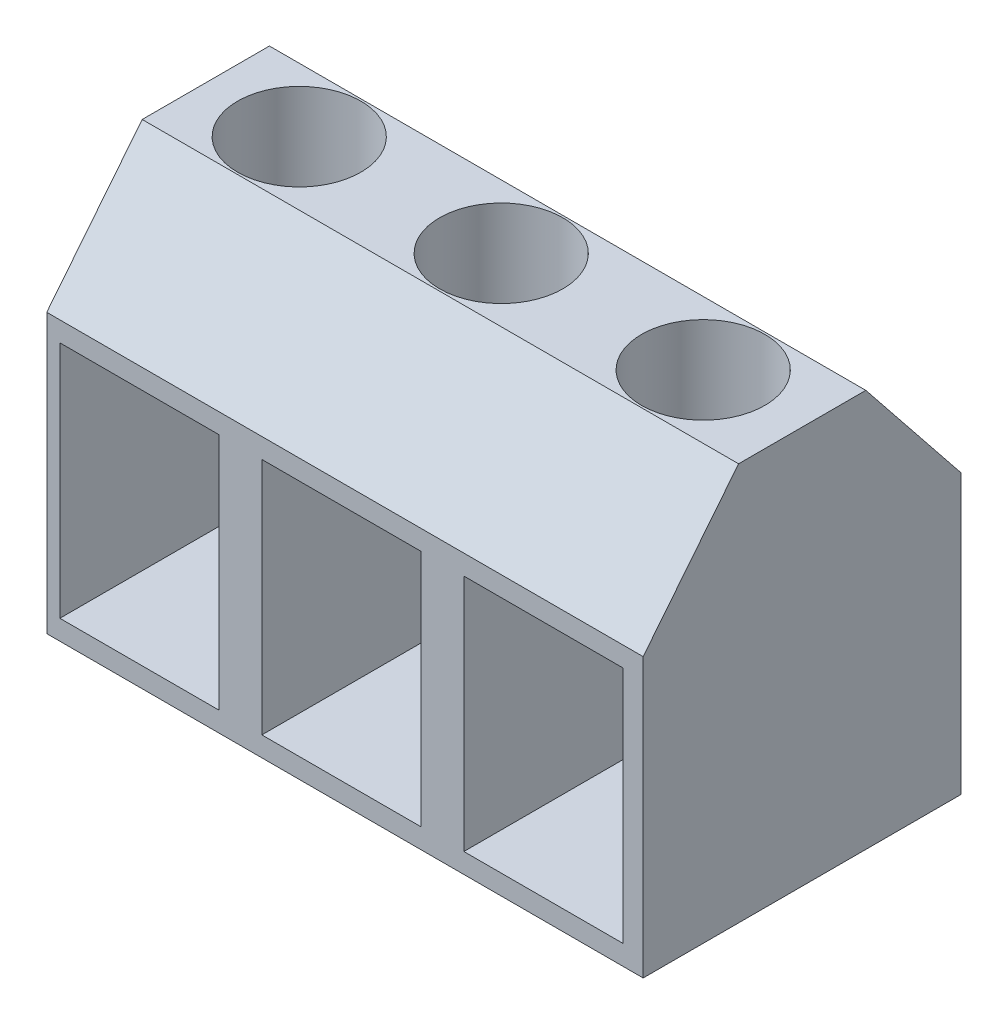
ISO-10303-21;
HEADER;
FILE_DESCRIPTION(('STEP AP214'),'2;1');
FILE_NAME('part.step','',(''),(''),'','','');
FILE_SCHEMA(('AUTOMOTIVE_DESIGN { 1 0 10303 214 1 1 1 1 }'));
ENDSEC;
DATA;
#1=APPLICATION_CONTEXT('core data for automotive mechanical design processes');
#2=APPLICATION_PROTOCOL_DEFINITION('international standard','automotive_design',2000,#1);
#3=PRODUCT_CONTEXT('',#1,'mechanical');
#4=PRODUCT('Part','Part','',(#3));
#5=PRODUCT_RELATED_PRODUCT_CATEGORY('part','',(#4));
#6=PRODUCT_DEFINITION_FORMATION('','',#4);
#7=PRODUCT_DEFINITION_CONTEXT('part definition',#1,'design');
#8=PRODUCT_DEFINITION('design','',#6,#7);
#9=PRODUCT_DEFINITION_SHAPE('','',#8);
#10=(LENGTH_UNIT() NAMED_UNIT(*) SI_UNIT(.MILLI.,.METRE.));
#11=(NAMED_UNIT(*) PLANE_ANGLE_UNIT() SI_UNIT($,.RADIAN.));
#12=(NAMED_UNIT(*) SI_UNIT($,.STERADIAN.) SOLID_ANGLE_UNIT());
#13=UNCERTAINTY_MEASURE_WITH_UNIT(LENGTH_MEASURE(1.E-05),#10,'distance_accuracy_value','');
#14=(GEOMETRIC_REPRESENTATION_CONTEXT(3) GLOBAL_UNCERTAINTY_ASSIGNED_CONTEXT((#13)) GLOBAL_UNIT_ASSIGNED_CONTEXT((#10,
#11,#12)) REPRESENTATION_CONTEXT('',''));
#15=CARTESIAN_POINT('',(0.,0.,0.));
#16=DIRECTION('',(0.,0.,1.));
#17=DIRECTION('',(1.,0.,0.));
#18=AXIS2_PLACEMENT_3D('',#15,#16,#17);
#19=CARTESIAN_POINT('',(15.,-3.7668913218139,2.85101682436601));
#20=DIRECTION('',(0.,-0.624695047554424,-0.78086880944303));
#21=DIRECTION('',(0.,0.78086880944303,-0.624695047554424));
#22=AXIS2_PLACEMENT_3D('',#19,#20,#21);
#23=PLANE('',#22);
#24=DIRECTION('',(0.,-0.78086880944303,0.624695047554424));
#25=VECTOR('',#24,1.);
#26=CARTESIAN_POINT('',(0.,-3.7668913218139,2.85101682436601));
#27=LINE('',#26,#25);
#28=CARTESIAN_POINT('',(0.,-0.766891321813898,0.451016824366012));
#29=VERTEX_POINT('',#28);
#30=CARTESIAN_POINT('',(0.,-3.7668913218139,2.85101682436601));
#31=VERTEX_POINT('',#30);
#32=EDGE_CURVE('E249',#29,#31,#27,.T.);
#33=ORIENTED_EDGE('',*,*,#32,.T.);
#34=DIRECTION('',(-1.,0.,0.));
#35=VECTOR('',#34,1.);
#36=CARTESIAN_POINT('',(15.,-3.7668913218139,2.85101682436601));
#37=LINE('',#36,#35);
#38=CARTESIAN_POINT('',(15.,-3.7668913218139,2.85101682436601));
#39=VERTEX_POINT('',#38);
#40=EDGE_CURVE('E12',#39,#31,#37,.T.);
#41=ORIENTED_EDGE('',*,*,#40,.F.);
#42=DIRECTION('',(0.,-0.78086880944303,0.624695047554424));
#43=VECTOR('',#42,1.);
#44=CARTESIAN_POINT('',(15.,-3.7668913218139,2.85101682436601));
#45=LINE('',#44,#43);
#46=CARTESIAN_POINT('',(15.,-0.766891321813898,0.451016824366012));
#47=VERTEX_POINT('',#46);
#48=EDGE_CURVE('E250',#47,#39,#45,.T.);
#49=ORIENTED_EDGE('',*,*,#48,.F.);
#50=DIRECTION('',(-1.,0.,0.));
#51=VECTOR('',#50,1.);
#52=CARTESIAN_POINT('',(15.,-0.766891321813898,0.451016824366012));
#53=LINE('',#52,#51);
#54=EDGE_CURVE('E264',#47,#29,#53,.T.);
#55=ORIENTED_EDGE('',*,*,#54,.T.);
#56=EDGE_LOOP('',(#33,#41,#49,#55));
#57=FACE_BOUND('',#56,.T.);
#58=ADVANCED_FACE('F34',(#57),#23,.F.);
#59=CARTESIAN_POINT('',(15.,-10.7668913218139,2.85101682436601));
#60=DIRECTION('',(0.,0.,-1.));
#61=DIRECTION('',(-1.,0.,0.));
#62=AXIS2_PLACEMENT_3D('',#59,#60,#61);
#63=PLANE('',#62);
#64=DIRECTION('',(1.,0.,0.));
#65=VECTOR('',#64,1.);
#66=CARTESIAN_POINT('',(5.41,-10.2668913218139,2.85101682436601));
#67=LINE('',#66,#65);
#68=CARTESIAN_POINT('',(5.41,-10.2668913218139,2.85101682436601));
#69=VERTEX_POINT('',#68);
#70=CARTESIAN_POINT('',(9.41,-10.2668913218139,2.85101682436601));
#71=VERTEX_POINT('',#70);
#72=EDGE_CURVE('E175',#69,#71,#67,.T.);
#73=ORIENTED_EDGE('',*,*,#72,.F.);
#74=DIRECTION('',(0.,-1.,0.));
#75=VECTOR('',#74,1.);
#76=CARTESIAN_POINT('',(5.41,-10.2668913218139,2.85101682436601));
#77=LINE('',#76,#75);
#78=CARTESIAN_POINT('',(5.41,-4.2668913218139,2.85101682436601));
#79=VERTEX_POINT('',#78);
#80=EDGE_CURVE('E48',#79,#69,#77,.T.);
#81=ORIENTED_EDGE('',*,*,#80,.F.);
#82=DIRECTION('',(-1.,0.,0.));
#83=VECTOR('',#82,1.);
#84=CARTESIAN_POINT('',(5.41,-4.2668913218139,2.85101682436601));
#85=LINE('',#84,#83);
#86=CARTESIAN_POINT('',(9.41,-4.2668913218139,2.85101682436601));
#87=VERTEX_POINT('',#86);
#88=EDGE_CURVE('E182',#87,#79,#85,.T.);
#89=ORIENTED_EDGE('',*,*,#88,.F.);
#90=DIRECTION('',(0.,1.,0.));
#91=VECTOR('',#90,1.);
#92=CARTESIAN_POINT('',(9.41,-10.2668913218139,2.85101682436601));
#93=LINE('',#92,#91);
#94=EDGE_CURVE('E165',#71,#87,#93,.T.);
#95=ORIENTED_EDGE('',*,*,#94,.F.);
#96=EDGE_LOOP('',(#73,#81,#89,#95));
#97=FACE_BOUND('',#96,.T.);
#98=DIRECTION('',(1.,0.,0.));
#99=VECTOR('',#98,1.);
#100=CARTESIAN_POINT('',(10.49,-10.2668913218139,2.85101682436601));
#101=LINE('',#100,#99);
#102=CARTESIAN_POINT('',(10.49,-10.2668913218139,2.85101682436601));
#103=VERTEX_POINT('',#102);
#104=CARTESIAN_POINT('',(14.49,-10.2668913218139,2.85101682436601));
#105=VERTEX_POINT('',#104);
#106=EDGE_CURVE('E204',#103,#105,#101,.T.);
#107=ORIENTED_EDGE('',*,*,#106,.F.);
#108=DIRECTION('',(0.,-1.,0.));
#109=VECTOR('',#108,1.);
#110=CARTESIAN_POINT('',(10.49,-10.2668913218139,2.85101682436601));
#111=LINE('',#110,#109);
#112=CARTESIAN_POINT('',(10.49,-4.2668913218139,2.85101682436601));
#113=VERTEX_POINT('',#112);
#114=EDGE_CURVE('E56',#113,#103,#111,.T.);
#115=ORIENTED_EDGE('',*,*,#114,.F.);
#116=DIRECTION('',(-1.,0.,0.));
#117=VECTOR('',#116,1.);
#118=CARTESIAN_POINT('',(10.49,-4.2668913218139,2.85101682436601));
#119=LINE('',#118,#117);
#120=CARTESIAN_POINT('',(14.49,-4.2668913218139,2.85101682436601));
#121=VERTEX_POINT('',#120);
#122=EDGE_CURVE('E211',#121,#113,#119,.T.);
#123=ORIENTED_EDGE('',*,*,#122,.F.);
#124=DIRECTION('',(0.,1.,0.));
#125=VECTOR('',#124,1.);
#126=CARTESIAN_POINT('',(14.49,-10.2668913218139,2.85101682436601));
#127=LINE('',#126,#125);
#128=EDGE_CURVE('E208',#105,#121,#127,.T.);
#129=ORIENTED_EDGE('',*,*,#128,.F.);
#130=EDGE_LOOP('',(#107,#115,#123,#129));
#131=FACE_BOUND('',#130,.T.);
#132=DIRECTION('',(1.,0.,0.));
#133=VECTOR('',#132,1.);
#134=CARTESIAN_POINT('',(0.33,-10.2668913218139,2.85101682436601));
#135=LINE('',#134,#133);
#136=CARTESIAN_POINT('',(0.33,-10.2668913218139,2.85101682436601));
#137=VERTEX_POINT('',#136);
#138=CARTESIAN_POINT('',(4.33,-10.2668913218139,2.85101682436601));
#139=VERTEX_POINT('',#138);
#140=EDGE_CURVE('E231',#137,#139,#135,.T.);
#141=ORIENTED_EDGE('',*,*,#140,.F.);
#142=DIRECTION('',(0.,-1.,0.));
#143=VECTOR('',#142,1.);
#144=CARTESIAN_POINT('',(0.33,-10.2668913218139,2.85101682436601));
#145=LINE('',#144,#143);
#146=CARTESIAN_POINT('',(0.33,-4.2668913218139,2.85101682436601));
#147=VERTEX_POINT('',#146);
#148=EDGE_CURVE('E193',#147,#137,#145,.T.);
#149=ORIENTED_EDGE('',*,*,#148,.F.);
#150=DIRECTION('',(-1.,0.,0.));
#151=VECTOR('',#150,1.);
#152=CARTESIAN_POINT('',(0.33,-4.2668913218139,2.85101682436601));
#153=LINE('',#152,#151);
#154=CARTESIAN_POINT('',(4.33,-4.2668913218139,2.85101682436601));
#155=VERTEX_POINT('',#154);
#156=EDGE_CURVE('E237',#155,#147,#153,.T.);
#157=ORIENTED_EDGE('',*,*,#156,.F.);
#158=DIRECTION('',(0.,1.,0.));
#159=VECTOR('',#158,1.);
#160=CARTESIAN_POINT('',(4.33,-10.2668913218139,2.85101682436601));
#161=LINE('',#160,#159);
#162=EDGE_CURVE('E234',#139,#155,#161,.T.);
#163=ORIENTED_EDGE('',*,*,#162,.F.);
#164=EDGE_LOOP('',(#141,#149,#157,#163));
#165=FACE_BOUND('',#164,.T.);
#166=DIRECTION('',(0.,-1.,0.));
#167=VECTOR('',#166,1.);
#168=CARTESIAN_POINT('',(0.,-10.7668913218139,2.85101682436601));
#169=LINE('',#168,#167);
#170=CARTESIAN_POINT('',(0.,-10.7668913218139,2.85101682436601));
#171=VERTEX_POINT('',#170);
#172=EDGE_CURVE('E267',#31,#171,#169,.T.);
#173=ORIENTED_EDGE('',*,*,#172,.T.);
#174=DIRECTION('',(-1.,0.,0.));
#175=VECTOR('',#174,1.);
#176=CARTESIAN_POINT('',(15.,-10.7668913218139,2.85101682436601));
#177=LINE('',#176,#175);
#178=CARTESIAN_POINT('',(15.,-10.7668913218139,2.85101682436601));
#179=VERTEX_POINT('',#178);
#180=EDGE_CURVE('E41',#179,#171,#177,.T.);
#181=ORIENTED_EDGE('',*,*,#180,.F.);
#182=DIRECTION('',(0.,-1.,0.));
#183=VECTOR('',#182,1.);
#184=CARTESIAN_POINT('',(15.,-10.7668913218139,2.85101682436601));
#185=LINE('',#184,#183);
#186=EDGE_CURVE('E253',#39,#179,#185,.T.);
#187=ORIENTED_EDGE('',*,*,#186,.F.);
#188=ORIENTED_EDGE('',*,*,#40,.T.);
#189=EDGE_LOOP('',(#173,#181,#187,#188));
#190=FACE_BOUND('',#189,.T.);
#191=ADVANCED_FACE('F179',(#97,#131,#165,#190),#63,.F.);
#192=CARTESIAN_POINT('',(15.,-10.7668913218139,-5.14898317563399));
#193=DIRECTION('',(0.,1.,0.));
#194=DIRECTION('',(0.,0.,1.));
#195=AXIS2_PLACEMENT_3D('',#192,#193,#194);
#196=PLANE('',#195);
#197=DIRECTION('',(0.,0.,-1.));
#198=VECTOR('',#197,1.);
#199=CARTESIAN_POINT('',(0.,-10.7668913218139,-5.14898317563399));
#200=LINE('',#199,#198);
#201=CARTESIAN_POINT('',(0.,-10.7668913218139,-5.14898317563399));
#202=VERTEX_POINT('',#201);
#203=EDGE_CURVE('E269',#171,#202,#200,.T.);
#204=ORIENTED_EDGE('',*,*,#203,.T.);
#205=DIRECTION('',(-1.,0.,0.));
#206=VECTOR('',#205,1.);
#207=CARTESIAN_POINT('',(15.,-10.7668913218139,-5.14898317563399));
#208=LINE('',#207,#206);
#209=CARTESIAN_POINT('',(15.,-10.7668913218139,-5.14898317563399));
#210=VERTEX_POINT('',#209);
#211=EDGE_CURVE('E284',#210,#202,#208,.T.);
#212=ORIENTED_EDGE('',*,*,#211,.F.);
#213=DIRECTION('',(0.,0.,-1.));
#214=VECTOR('',#213,1.);
#215=CARTESIAN_POINT('',(15.,-10.7668913218139,-5.14898317563399));
#216=LINE('',#215,#214);
#217=EDGE_CURVE('E256',#179,#210,#216,.T.);
#218=ORIENTED_EDGE('',*,*,#217,.F.);
#219=ORIENTED_EDGE('',*,*,#180,.T.);
#220=EDGE_LOOP('',(#204,#212,#218,#219));
#221=FACE_BOUND('',#220,.T.);
#222=ADVANCED_FACE('F291',(#221),#196,.F.);
#223=CARTESIAN_POINT('',(15.,-3.7668913218139,-5.14898317563399));
#224=DIRECTION('',(0.,0.,1.));
#225=DIRECTION('',(1.,0.,0.));
#226=AXIS2_PLACEMENT_3D('',#223,#224,#225);
#227=PLANE('',#226);
#228=DIRECTION('',(0.,1.,0.));
#229=VECTOR('',#228,1.);
#230=CARTESIAN_POINT('',(0.,-3.7668913218139,-5.14898317563399));
#231=LINE('',#230,#229);
#232=CARTESIAN_POINT('',(0.,-3.7668913218139,-5.14898317563399));
#233=VERTEX_POINT('',#232);
#234=EDGE_CURVE('E271',#202,#233,#231,.T.);
#235=ORIENTED_EDGE('',*,*,#234,.T.);
#236=DIRECTION('',(-1.,0.,0.));
#237=VECTOR('',#236,1.);
#238=CARTESIAN_POINT('',(15.,-3.7668913218139,-5.14898317563399));
#239=LINE('',#238,#237);
#240=CARTESIAN_POINT('',(15.,-3.7668913218139,-5.14898317563399));
#241=VERTEX_POINT('',#240);
#242=EDGE_CURVE('E281',#241,#233,#239,.T.);
#243=ORIENTED_EDGE('',*,*,#242,.F.);
#244=DIRECTION('',(0.,1.,0.));
#245=VECTOR('',#244,1.);
#246=CARTESIAN_POINT('',(15.,-3.7668913218139,-5.14898317563399));
#247=LINE('',#246,#245);
#248=EDGE_CURVE('E258',#210,#241,#247,.T.);
#249=ORIENTED_EDGE('',*,*,#248,.F.);
#250=ORIENTED_EDGE('',*,*,#211,.T.);
#251=EDGE_LOOP('',(#235,#243,#249,#250));
#252=FACE_BOUND('',#251,.T.);
#253=ADVANCED_FACE('F302',(#252),#227,.F.);
#254=CARTESIAN_POINT('',(15.,-0.766891321813898,-2.74898317563399));
#255=DIRECTION('',(0.,-0.624695047554424,0.78086880944303));
#256=DIRECTION('',(0.,-0.78086880944303,-0.624695047554424));
#257=AXIS2_PLACEMENT_3D('',#254,#255,#256);
#258=PLANE('',#257);
#259=DIRECTION('',(0.,0.78086880944303,0.624695047554424));
#260=VECTOR('',#259,1.);
#261=CARTESIAN_POINT('',(0.,-0.766891321813898,-2.74898317563399));
#262=LINE('',#261,#260);
#263=CARTESIAN_POINT('',(0.,-0.766891321813898,-2.74898317563399));
#264=VERTEX_POINT('',#263);
#265=EDGE_CURVE('E273',#233,#264,#262,.T.);
#266=ORIENTED_EDGE('',*,*,#265,.T.);
#267=DIRECTION('',(-1.,0.,0.));
#268=VECTOR('',#267,1.);
#269=CARTESIAN_POINT('',(15.,-0.766891321813898,-2.74898317563399));
#270=LINE('',#269,#268);
#271=CARTESIAN_POINT('',(15.,-0.766891321813898,-2.74898317563399));
#272=VERTEX_POINT('',#271);
#273=EDGE_CURVE('E278',#272,#264,#270,.T.);
#274=ORIENTED_EDGE('',*,*,#273,.F.);
#275=DIRECTION('',(0.,0.78086880944303,0.624695047554424));
#276=VECTOR('',#275,1.);
#277=CARTESIAN_POINT('',(15.,-0.766891321813898,-2.74898317563399));
#278=LINE('',#277,#276);
#279=EDGE_CURVE('E260',#241,#272,#278,.T.);
#280=ORIENTED_EDGE('',*,*,#279,.F.);
#281=ORIENTED_EDGE('',*,*,#242,.T.);
#282=EDGE_LOOP('',(#266,#274,#280,#281));
#283=FACE_BOUND('',#282,.T.);
#284=ADVANCED_FACE('F306',(#283),#258,.F.);
#285=CARTESIAN_POINT('',(15.,-0.766891321813898,0.451016824366012));
#286=DIRECTION('',(0.,-1.,0.));
#287=DIRECTION('',(0.,0.,-1.));
#288=AXIS2_PLACEMENT_3D('',#285,#286,#287);
#289=PLANE('',#288);
#290=CARTESIAN_POINT('',(7.43,-0.766891321813898,-1.14898317563399));
#291=DIRECTION('',(0.,1.,0.));
#292=DIRECTION('',(0.,0.,1.));
#293=AXIS2_PLACEMENT_3D('',#290,#291,#292);
#294=CIRCLE('',#293,1.55);
#295=CARTESIAN_POINT('',(7.43,-0.766891321813898,0.401016824366011));
#296=VERTEX_POINT('',#295);
#297=EDGE_CURVE('E556',#296,#296,#294,.T.);
#298=ORIENTED_EDGE('',*,*,#297,.F.);
#299=EDGE_LOOP('',(#298));
#300=FACE_BOUND('',#299,.T.);
#301=CARTESIAN_POINT('',(12.51,-0.766891321813898,-1.14898317563399));
#302=DIRECTION('',(0.,1.,0.));
#303=DIRECTION('',(0.,0.,1.));
#304=AXIS2_PLACEMENT_3D('',#301,#302,#303);
#305=CIRCLE('',#304,1.55);
#306=CARTESIAN_POINT('',(12.51,-0.766891321813898,0.401016824366011));
#307=VERTEX_POINT('',#306);
#308=EDGE_CURVE('E554',#307,#307,#305,.T.);
#309=ORIENTED_EDGE('',*,*,#308,.F.);
#310=EDGE_LOOP('',(#309));
#311=FACE_BOUND('',#310,.T.);
#312=CARTESIAN_POINT('',(2.35,-0.766891321813898,-1.14898317563399));
#313=DIRECTION('',(0.,1.,0.));
#314=DIRECTION('',(0.,0.,1.));
#315=AXIS2_PLACEMENT_3D('',#312,#313,#314);
#316=CIRCLE('',#315,1.55);
#317=CARTESIAN_POINT('',(2.35,-0.766891321813898,0.401016824366012));
#318=VERTEX_POINT('',#317);
#319=EDGE_CURVE('E562',#318,#318,#316,.T.);
#320=ORIENTED_EDGE('',*,*,#319,.F.);
#321=EDGE_LOOP('',(#320));
#322=FACE_BOUND('',#321,.T.);
#323=DIRECTION('',(0.,0.,1.));
#324=VECTOR('',#323,1.);
#325=CARTESIAN_POINT('',(0.,-0.766891321813898,0.451016824366012));
#326=LINE('',#325,#324);
#327=EDGE_CURVE('E254',#264,#29,#326,.T.);
#328=ORIENTED_EDGE('',*,*,#327,.T.);
#329=ORIENTED_EDGE('',*,*,#54,.F.);
#330=DIRECTION('',(0.,0.,1.));
#331=VECTOR('',#330,1.);
#332=CARTESIAN_POINT('',(15.,-0.766891321813898,0.451016824366012));
#333=LINE('',#332,#331);
#334=EDGE_CURVE('E262',#272,#47,#333,.T.);
#335=ORIENTED_EDGE('',*,*,#334,.F.);
#336=ORIENTED_EDGE('',*,*,#273,.T.);
#337=EDGE_LOOP('',(#328,#329,#335,#336));
#338=FACE_BOUND('',#337,.T.);
#339=ADVANCED_FACE('F316',(#300,#311,#322,#338),#289,.F.);
#340=CARTESIAN_POINT('',(15.,0.,0.));
#341=DIRECTION('',(-1.,0.,0.));
#342=DIRECTION('',(0.,0.,1.));
#343=AXIS2_PLACEMENT_3D('',#340,#341,#342);
#344=PLANE('',#343);
#345=ORIENTED_EDGE('',*,*,#48,.T.);
#346=ORIENTED_EDGE('',*,*,#186,.T.);
#347=ORIENTED_EDGE('',*,*,#217,.T.);
#348=ORIENTED_EDGE('',*,*,#248,.T.);
#349=ORIENTED_EDGE('',*,*,#279,.T.);
#350=ORIENTED_EDGE('',*,*,#334,.T.);
#351=EDGE_LOOP('',(#345,#346,#347,#348,#349,#350));
#352=FACE_BOUND('',#351,.T.);
#353=ADVANCED_FACE('F310',(#352),#344,.F.);
#354=CARTESIAN_POINT('',(0.,0.,0.));
#355=DIRECTION('',(-1.,0.,0.));
#356=DIRECTION('',(0.,0.,1.));
#357=AXIS2_PLACEMENT_3D('',#354,#355,#356);
#358=PLANE('',#357);
#359=ORIENTED_EDGE('',*,*,#32,.F.);
#360=ORIENTED_EDGE('',*,*,#327,.F.);
#361=ORIENTED_EDGE('',*,*,#265,.F.);
#362=ORIENTED_EDGE('',*,*,#234,.F.);
#363=ORIENTED_EDGE('',*,*,#203,.F.);
#364=ORIENTED_EDGE('',*,*,#172,.F.);
#365=EDGE_LOOP('',(#359,#360,#361,#362,#363,#364));
#366=FACE_BOUND('',#365,.T.);
#367=ADVANCED_FACE('F297',(#366),#358,.T.);
#368=CARTESIAN_POINT('',(0.33,-10.2668913218139,-12.360085726562));
#369=DIRECTION('',(-1.,0.,0.));
#370=DIRECTION('',(0.,0.,1.));
#371=AXIS2_PLACEMENT_3D('',#368,#369,#370);
#372=PLANE('',#371);
#373=DIRECTION('',(0.,1.,0.));
#374=VECTOR('',#373,1.);
#375=CARTESIAN_POINT('',(0.33,-10.2668913218139,-4.64898317563399));
#376=LINE('',#375,#374);
#377=CARTESIAN_POINT('',(0.33,-10.2668913218139,-4.64898317563399));
#378=VERTEX_POINT('',#377);
#379=CARTESIAN_POINT('',(0.33,-4.2668913218139,-4.64898317563399));
#380=VERTEX_POINT('',#379);
#381=EDGE_CURVE('E227',#378,#380,#376,.T.);
#382=ORIENTED_EDGE('',*,*,#381,.T.);
#383=DIRECTION('',(0.,0.,1.));
#384=VECTOR('',#383,1.);
#385=CARTESIAN_POINT('',(0.33,-4.2668913218139,-12.360085726562));
#386=LINE('',#385,#384);
#387=EDGE_CURVE('E225',#380,#147,#386,.T.);
#388=ORIENTED_EDGE('',*,*,#387,.T.);
#389=ORIENTED_EDGE('',*,*,#148,.T.);
#390=DIRECTION('',(0.,0.,1.));
#391=VECTOR('',#390,1.);
#392=CARTESIAN_POINT('',(0.33,-10.2668913218139,-12.360085726562));
#393=LINE('',#392,#391);
#394=EDGE_CURVE('E240',#378,#137,#393,.T.);
#395=ORIENTED_EDGE('',*,*,#394,.F.);
#396=EDGE_LOOP('',(#382,#388,#389,#395));
#397=FACE_BOUND('',#396,.T.);
#398=ADVANCED_FACE('F362',(#397),#372,.F.);
#399=CARTESIAN_POINT('',(0.33,-4.2668913218139,-12.360085726562));
#400=DIRECTION('',(0.,1.,0.));
#401=DIRECTION('',(0.,0.,1.));
#402=AXIS2_PLACEMENT_3D('',#399,#400,#401);
#403=PLANE('',#402);
#404=CARTESIAN_POINT('',(2.35,-4.2668913218139,-1.14898317563399));
#405=DIRECTION('',(0.,1.,0.));
#406=DIRECTION('',(0.,0.,1.));
#407=AXIS2_PLACEMENT_3D('',#404,#405,#406);
#408=CIRCLE('',#407,1.55);
#409=CARTESIAN_POINT('',(2.35,-4.2668913218139,0.401016824366012));
#410=VERTEX_POINT('',#409);
#411=EDGE_CURVE('E205',#410,#410,#408,.F.);
#412=ORIENTED_EDGE('',*,*,#411,.F.);
#413=EDGE_LOOP('',(#412));
#414=FACE_BOUND('',#413,.T.);
#415=DIRECTION('',(1.,0.,0.));
#416=VECTOR('',#415,1.);
#417=CARTESIAN_POINT('',(0.33,-4.2668913218139,-4.64898317563399));
#418=LINE('',#417,#416);
#419=CARTESIAN_POINT('',(4.33,-4.2668913218139,-4.64898317563399));
#420=VERTEX_POINT('',#419);
#421=EDGE_CURVE('E224',#380,#420,#418,.T.);
#422=ORIENTED_EDGE('',*,*,#421,.T.);
#423=DIRECTION('',(0.,0.,1.));
#424=VECTOR('',#423,1.);
#425=CARTESIAN_POINT('',(4.33,-4.2668913218139,-12.360085726562));
#426=LINE('',#425,#424);
#427=EDGE_CURVE('E242',#420,#155,#426,.T.);
#428=ORIENTED_EDGE('',*,*,#427,.T.);
#429=ORIENTED_EDGE('',*,*,#156,.T.);
#430=ORIENTED_EDGE('',*,*,#387,.F.);
#431=EDGE_LOOP('',(#422,#428,#429,#430));
#432=FACE_BOUND('',#431,.T.);
#433=ADVANCED_FACE('F377',(#414,#432),#403,.F.);
#434=CARTESIAN_POINT('',(4.33,-10.2668913218139,-12.360085726562));
#435=DIRECTION('',(1.,0.,0.));
#436=DIRECTION('',(0.,0.,-1.));
#437=AXIS2_PLACEMENT_3D('',#434,#435,#436);
#438=PLANE('',#437);
#439=DIRECTION('',(0.,-1.,0.));
#440=VECTOR('',#439,1.);
#441=CARTESIAN_POINT('',(4.33,-10.2668913218139,-4.64898317563399));
#442=LINE('',#441,#440);
#443=CARTESIAN_POINT('',(4.33,-10.2668913218139,-4.64898317563399));
#444=VERTEX_POINT('',#443);
#445=EDGE_CURVE('E222',#420,#444,#442,.T.);
#446=ORIENTED_EDGE('',*,*,#445,.T.);
#447=DIRECTION('',(0.,0.,1.));
#448=VECTOR('',#447,1.);
#449=CARTESIAN_POINT('',(4.33,-10.2668913218139,-12.360085726562));
#450=LINE('',#449,#448);
#451=EDGE_CURVE('E244',#444,#139,#450,.T.);
#452=ORIENTED_EDGE('',*,*,#451,.T.);
#453=ORIENTED_EDGE('',*,*,#162,.T.);
#454=ORIENTED_EDGE('',*,*,#427,.F.);
#455=EDGE_LOOP('',(#446,#452,#453,#454));
#456=FACE_BOUND('',#455,.T.);
#457=ADVANCED_FACE('F385',(#456),#438,.F.);
#458=CARTESIAN_POINT('',(0.33,-10.2668913218139,-12.360085726562));
#459=DIRECTION('',(0.,-1.,0.));
#460=DIRECTION('',(0.,0.,-1.));
#461=AXIS2_PLACEMENT_3D('',#458,#459,#460);
#462=PLANE('',#461);
#463=DIRECTION('',(-1.,0.,0.));
#464=VECTOR('',#463,1.);
#465=CARTESIAN_POINT('',(0.33,-10.2668913218139,-4.64898317563399));
#466=LINE('',#465,#464);
#467=EDGE_CURVE('E229',#444,#378,#466,.T.);
#468=ORIENTED_EDGE('',*,*,#467,.T.);
#469=ORIENTED_EDGE('',*,*,#394,.T.);
#470=ORIENTED_EDGE('',*,*,#140,.T.);
#471=ORIENTED_EDGE('',*,*,#451,.F.);
#472=EDGE_LOOP('',(#468,#469,#470,#471));
#473=FACE_BOUND('',#472,.T.);
#474=ADVANCED_FACE('F390',(#473),#462,.F.);
#475=CARTESIAN_POINT('',(15.,-3.7668913218139,-4.64898317563399));
#476=DIRECTION('',(0.,0.,1.));
#477=DIRECTION('',(1.,0.,0.));
#478=AXIS2_PLACEMENT_3D('',#475,#476,#477);
#479=PLANE('',#478);
#480=ORIENTED_EDGE('',*,*,#381,.F.);
#481=ORIENTED_EDGE('',*,*,#467,.F.);
#482=ORIENTED_EDGE('',*,*,#445,.F.);
#483=ORIENTED_EDGE('',*,*,#421,.F.);
#484=EDGE_LOOP('',(#480,#481,#482,#483));
#485=FACE_BOUND('',#484,.T.);
#486=ADVANCED_FACE('F400',(#485),#479,.T.);
#487=CARTESIAN_POINT('',(10.49,-10.2668913218139,-12.360085726562));
#488=DIRECTION('',(-1.,0.,0.));
#489=DIRECTION('',(0.,0.,1.));
#490=AXIS2_PLACEMENT_3D('',#487,#488,#489);
#491=PLANE('',#490);
#492=DIRECTION('',(0.,1.,0.));
#493=VECTOR('',#492,1.);
#494=CARTESIAN_POINT('',(10.49,-10.2668913218139,-4.64898317563399));
#495=LINE('',#494,#493);
#496=CARTESIAN_POINT('',(10.49,-10.2668913218139,-4.64898317563399));
#497=VERTEX_POINT('',#496);
#498=CARTESIAN_POINT('',(10.49,-4.2668913218139,-4.64898317563399));
#499=VERTEX_POINT('',#498);
#500=EDGE_CURVE('E200',#497,#499,#495,.T.);
#501=ORIENTED_EDGE('',*,*,#500,.T.);
#502=DIRECTION('',(0.,0.,1.));
#503=VECTOR('',#502,1.);
#504=CARTESIAN_POINT('',(10.49,-4.2668913218139,-12.360085726562));
#505=LINE('',#504,#503);
#506=EDGE_CURVE('E198',#499,#113,#505,.T.);
#507=ORIENTED_EDGE('',*,*,#506,.T.);
#508=ORIENTED_EDGE('',*,*,#114,.T.);
#509=DIRECTION('',(0.,0.,1.));
#510=VECTOR('',#509,1.);
#511=CARTESIAN_POINT('',(10.49,-10.2668913218139,-12.360085726562));
#512=LINE('',#511,#510);
#513=EDGE_CURVE('E214',#497,#103,#512,.T.);
#514=ORIENTED_EDGE('',*,*,#513,.F.);
#515=EDGE_LOOP('',(#501,#507,#508,#514));
#516=FACE_BOUND('',#515,.T.);
#517=ADVANCED_FACE('F410',(#516),#491,.F.);
#518=CARTESIAN_POINT('',(10.49,-4.2668913218139,-12.360085726562));
#519=DIRECTION('',(0.,1.,0.));
#520=DIRECTION('',(0.,0.,1.));
#521=AXIS2_PLACEMENT_3D('',#518,#519,#520);
#522=PLANE('',#521);
#523=CARTESIAN_POINT('',(12.51,-4.2668913218139,-1.14898317563399));
#524=DIRECTION('',(0.,1.,0.));
#525=DIRECTION('',(0.,0.,1.));
#526=AXIS2_PLACEMENT_3D('',#523,#524,#525);
#527=CIRCLE('',#526,1.55);
#528=CARTESIAN_POINT('',(12.51,-4.2668913218139,0.401016824366011));
#529=VERTEX_POINT('',#528);
#530=EDGE_CURVE('E551',#529,#529,#527,.F.);
#531=ORIENTED_EDGE('',*,*,#530,.F.);
#532=EDGE_LOOP('',(#531));
#533=FACE_BOUND('',#532,.T.);
#534=DIRECTION('',(1.,0.,0.));
#535=VECTOR('',#534,1.);
#536=CARTESIAN_POINT('',(10.49,-4.2668913218139,-4.64898317563399));
#537=LINE('',#536,#535);
#538=CARTESIAN_POINT('',(14.49,-4.2668913218139,-4.64898317563399));
#539=VERTEX_POINT('',#538);
#540=EDGE_CURVE('E197',#499,#539,#537,.T.);
#541=ORIENTED_EDGE('',*,*,#540,.T.);
#542=DIRECTION('',(0.,0.,1.));
#543=VECTOR('',#542,1.);
#544=CARTESIAN_POINT('',(14.49,-4.2668913218139,-12.360085726562));
#545=LINE('',#544,#543);
#546=EDGE_CURVE('E216',#539,#121,#545,.T.);
#547=ORIENTED_EDGE('',*,*,#546,.T.);
#548=ORIENTED_EDGE('',*,*,#122,.T.);
#549=ORIENTED_EDGE('',*,*,#506,.F.);
#550=EDGE_LOOP('',(#541,#547,#548,#549));
#551=FACE_BOUND('',#550,.T.);
#552=ADVANCED_FACE('F420',(#533,#551),#522,.F.);
#553=CARTESIAN_POINT('',(14.49,-10.2668913218139,-12.360085726562));
#554=DIRECTION('',(1.,0.,0.));
#555=DIRECTION('',(0.,0.,-1.));
#556=AXIS2_PLACEMENT_3D('',#553,#554,#555);
#557=PLANE('',#556);
#558=DIRECTION('',(0.,-1.,0.));
#559=VECTOR('',#558,1.);
#560=CARTESIAN_POINT('',(14.49,-10.2668913218139,-4.64898317563399));
#561=LINE('',#560,#559);
#562=CARTESIAN_POINT('',(14.49,-10.2668913218139,-4.64898317563399));
#563=VERTEX_POINT('',#562);
#564=EDGE_CURVE('E195',#539,#563,#561,.T.);
#565=ORIENTED_EDGE('',*,*,#564,.T.);
#566=DIRECTION('',(0.,0.,1.));
#567=VECTOR('',#566,1.);
#568=CARTESIAN_POINT('',(14.49,-10.2668913218139,-12.360085726562));
#569=LINE('',#568,#567);
#570=EDGE_CURVE('E218',#563,#105,#569,.T.);
#571=ORIENTED_EDGE('',*,*,#570,.T.);
#572=ORIENTED_EDGE('',*,*,#128,.T.);
#573=ORIENTED_EDGE('',*,*,#546,.F.);
#574=EDGE_LOOP('',(#565,#571,#572,#573));
#575=FACE_BOUND('',#574,.T.);
#576=ADVANCED_FACE('F427',(#575),#557,.F.);
#577=CARTESIAN_POINT('',(10.49,-10.2668913218139,-12.360085726562));
#578=DIRECTION('',(0.,-1.,0.));
#579=DIRECTION('',(0.,0.,-1.));
#580=AXIS2_PLACEMENT_3D('',#577,#578,#579);
#581=PLANE('',#580);
#582=DIRECTION('',(-1.,0.,0.));
#583=VECTOR('',#582,1.);
#584=CARTESIAN_POINT('',(10.49,-10.2668913218139,-4.64898317563399));
#585=LINE('',#584,#583);
#586=EDGE_CURVE('E202',#563,#497,#585,.T.);
#587=ORIENTED_EDGE('',*,*,#586,.T.);
#588=ORIENTED_EDGE('',*,*,#513,.T.);
#589=ORIENTED_EDGE('',*,*,#106,.T.);
#590=ORIENTED_EDGE('',*,*,#570,.F.);
#591=EDGE_LOOP('',(#587,#588,#589,#590));
#592=FACE_BOUND('',#591,.T.);
#593=ADVANCED_FACE('F432',(#592),#581,.F.);
#594=CARTESIAN_POINT('',(15.,-3.7668913218139,-4.64898317563399));
#595=DIRECTION('',(0.,0.,1.));
#596=DIRECTION('',(1.,0.,0.));
#597=AXIS2_PLACEMENT_3D('',#594,#595,#596);
#598=PLANE('',#597);
#599=ORIENTED_EDGE('',*,*,#500,.F.);
#600=ORIENTED_EDGE('',*,*,#586,.F.);
#601=ORIENTED_EDGE('',*,*,#564,.F.);
#602=ORIENTED_EDGE('',*,*,#540,.F.);
#603=EDGE_LOOP('',(#599,#600,#601,#602));
#604=FACE_BOUND('',#603,.T.);
#605=ADVANCED_FACE('F442',(#604),#598,.T.);
#606=CARTESIAN_POINT('',(5.41,-10.2668913218139,-12.360085726562));
#607=DIRECTION('',(-1.,0.,0.));
#608=DIRECTION('',(0.,0.,1.));
#609=AXIS2_PLACEMENT_3D('',#606,#607,#608);
#610=PLANE('',#609);
#611=DIRECTION('',(0.,1.,0.));
#612=VECTOR('',#611,1.);
#613=CARTESIAN_POINT('',(5.41,-10.2668913218139,-4.64898317563399));
#614=LINE('',#613,#612);
#615=CARTESIAN_POINT('',(5.41,-10.2668913218139,-4.64898317563399));
#616=VERTEX_POINT('',#615);
#617=CARTESIAN_POINT('',(5.41,-4.2668913218139,-4.64898317563399));
#618=VERTEX_POINT('',#617);
#619=EDGE_CURVE('E194',#616,#618,#614,.T.);
#620=ORIENTED_EDGE('',*,*,#619,.T.);
#621=DIRECTION('',(0.,0.,1.));
#622=VECTOR('',#621,1.);
#623=CARTESIAN_POINT('',(5.41,-4.2668913218139,-12.360085726562));
#624=LINE('',#623,#622);
#625=EDGE_CURVE('E187',#618,#79,#624,.T.);
#626=ORIENTED_EDGE('',*,*,#625,.T.);
#627=ORIENTED_EDGE('',*,*,#80,.T.);
#628=DIRECTION('',(0.,0.,1.));
#629=VECTOR('',#628,1.);
#630=CARTESIAN_POINT('',(5.41,-10.2668913218139,-12.360085726562));
#631=LINE('',#630,#629);
#632=EDGE_CURVE('E172',#616,#69,#631,.T.);
#633=ORIENTED_EDGE('',*,*,#632,.F.);
#634=EDGE_LOOP('',(#620,#626,#627,#633));
#635=FACE_BOUND('',#634,.T.);
#636=ADVANCED_FACE('F452',(#635),#610,.F.);
#637=CARTESIAN_POINT('',(5.41,-4.2668913218139,-12.360085726562));
#638=DIRECTION('',(0.,1.,0.));
#639=DIRECTION('',(0.,0.,1.));
#640=AXIS2_PLACEMENT_3D('',#637,#638,#639);
#641=PLANE('',#640);
#642=CARTESIAN_POINT('',(7.43,-4.2668913218139,-1.14898317563399));
#643=DIRECTION('',(0.,1.,0.));
#644=DIRECTION('',(0.,0.,1.));
#645=AXIS2_PLACEMENT_3D('',#642,#643,#644);
#646=CIRCLE('',#645,1.55);
#647=CARTESIAN_POINT('',(7.43,-4.2668913218139,0.401016824366011));
#648=VERTEX_POINT('',#647);
#649=EDGE_CURVE('E559',#648,#648,#646,.F.);
#650=ORIENTED_EDGE('',*,*,#649,.F.);
#651=EDGE_LOOP('',(#650));
#652=FACE_BOUND('',#651,.T.);
#653=DIRECTION('',(1.,0.,0.));
#654=VECTOR('',#653,1.);
#655=CARTESIAN_POINT('',(5.41,-4.2668913218139,-4.64898317563399));
#656=LINE('',#655,#654);
#657=CARTESIAN_POINT('',(9.41,-4.2668913218139,-4.64898317563399));
#658=VERTEX_POINT('',#657);
#659=EDGE_CURVE('E568',#618,#658,#656,.T.);
#660=ORIENTED_EDGE('',*,*,#659,.T.);
#661=DIRECTION('',(0.,0.,1.));
#662=VECTOR('',#661,1.);
#663=CARTESIAN_POINT('',(9.41,-4.2668913218139,-12.360085726562));
#664=LINE('',#663,#662);
#665=EDGE_CURVE('E171',#658,#87,#664,.T.);
#666=ORIENTED_EDGE('',*,*,#665,.T.);
#667=ORIENTED_EDGE('',*,*,#88,.T.);
#668=ORIENTED_EDGE('',*,*,#625,.F.);
#669=EDGE_LOOP('',(#660,#666,#667,#668));
#670=FACE_BOUND('',#669,.T.);
#671=ADVANCED_FACE('F462',(#652,#670),#641,.F.);
#672=CARTESIAN_POINT('',(9.41,-10.2668913218139,-12.360085726562));
#673=DIRECTION('',(1.,0.,0.));
#674=DIRECTION('',(0.,0.,-1.));
#675=AXIS2_PLACEMENT_3D('',#672,#673,#674);
#676=PLANE('',#675);
#677=DIRECTION('',(0.,-1.,0.));
#678=VECTOR('',#677,1.);
#679=CARTESIAN_POINT('',(9.41,-10.2668913218139,-4.64898317563399));
#680=LINE('',#679,#678);
#681=CARTESIAN_POINT('',(9.41,-10.2668913218139,-4.64898317563399));
#682=VERTEX_POINT('',#681);
#683=EDGE_CURVE('E168',#658,#682,#680,.T.);
#684=ORIENTED_EDGE('',*,*,#683,.T.);
#685=DIRECTION('',(0.,0.,1.));
#686=VECTOR('',#685,1.);
#687=CARTESIAN_POINT('',(9.41,-10.2668913218139,-12.360085726562));
#688=LINE('',#687,#686);
#689=EDGE_CURVE('E160',#682,#71,#688,.T.);
#690=ORIENTED_EDGE('',*,*,#689,.T.);
#691=ORIENTED_EDGE('',*,*,#94,.T.);
#692=ORIENTED_EDGE('',*,*,#665,.F.);
#693=EDGE_LOOP('',(#684,#690,#691,#692));
#694=FACE_BOUND('',#693,.T.);
#695=ADVANCED_FACE('F162',(#694),#676,.F.);
#696=CARTESIAN_POINT('',(5.41,-10.2668913218139,-12.360085726562));
#697=DIRECTION('',(0.,-1.,0.));
#698=DIRECTION('',(0.,0.,-1.));
#699=AXIS2_PLACEMENT_3D('',#696,#697,#698);
#700=PLANE('',#699);
#701=DIRECTION('',(-1.,0.,0.));
#702=VECTOR('',#701,1.);
#703=CARTESIAN_POINT('',(5.41,-10.2668913218139,-4.64898317563399));
#704=LINE('',#703,#702);
#705=EDGE_CURVE('E191',#682,#616,#704,.T.);
#706=ORIENTED_EDGE('',*,*,#705,.T.);
#707=ORIENTED_EDGE('',*,*,#632,.T.);
#708=ORIENTED_EDGE('',*,*,#72,.T.);
#709=ORIENTED_EDGE('',*,*,#689,.F.);
#710=EDGE_LOOP('',(#706,#707,#708,#709));
#711=FACE_BOUND('',#710,.T.);
#712=ADVANCED_FACE('F176',(#711),#700,.F.);
#713=CARTESIAN_POINT('',(15.,-3.7668913218139,-4.64898317563399));
#714=DIRECTION('',(0.,0.,1.));
#715=DIRECTION('',(1.,0.,0.));
#716=AXIS2_PLACEMENT_3D('',#713,#714,#715);
#717=PLANE('',#716);
#718=ORIENTED_EDGE('',*,*,#619,.F.);
#719=ORIENTED_EDGE('',*,*,#705,.F.);
#720=ORIENTED_EDGE('',*,*,#683,.F.);
#721=ORIENTED_EDGE('',*,*,#659,.F.);
#722=EDGE_LOOP('',(#718,#719,#720,#721));
#723=FACE_BOUND('',#722,.T.);
#724=ADVANCED_FACE('F481',(#723),#717,.T.);
#725=CARTESIAN_POINT('',(2.35,-8.65095336517049,-1.14898317563399));
#726=DIRECTION('',(0.,1.,0.));
#727=DIRECTION('',(0.,0.,1.));
#728=AXIS2_PLACEMENT_3D('',#725,#726,#727);
#729=CYLINDRICAL_SURFACE('',#728,1.55);
#730=ORIENTED_EDGE('',*,*,#411,.T.);
#731=EDGE_LOOP('',(#730));
#732=FACE_BOUND('',#731,.T.);
#733=ORIENTED_EDGE('',*,*,#319,.T.);
#734=EDGE_LOOP('',(#733));
#735=FACE_BOUND('',#734,.T.);
#736=ADVANCED_FACE('F489',(#732,#735),#729,.F.);
#737=CARTESIAN_POINT('',(7.43,-8.65095336517049,-1.14898317563399));
#738=DIRECTION('',(0.,1.,0.));
#739=DIRECTION('',(0.,0.,1.));
#740=AXIS2_PLACEMENT_3D('',#737,#738,#739);
#741=CYLINDRICAL_SURFACE('',#740,1.55);
#742=ORIENTED_EDGE('',*,*,#649,.T.);
#743=EDGE_LOOP('',(#742));
#744=FACE_BOUND('',#743,.T.);
#745=ORIENTED_EDGE('',*,*,#297,.T.);
#746=EDGE_LOOP('',(#745));
#747=FACE_BOUND('',#746,.T.);
#748=ADVANCED_FACE('F524',(#744,#747),#741,.F.);
#749=CARTESIAN_POINT('',(12.51,-8.65095336517049,-1.14898317563399));
#750=DIRECTION('',(0.,1.,0.));
#751=DIRECTION('',(0.,0.,1.));
#752=AXIS2_PLACEMENT_3D('',#749,#750,#751);
#753=CYLINDRICAL_SURFACE('',#752,1.55);
#754=ORIENTED_EDGE('',*,*,#530,.T.);
#755=EDGE_LOOP('',(#754));
#756=FACE_BOUND('',#755,.T.);
#757=ORIENTED_EDGE('',*,*,#308,.T.);
#758=EDGE_LOOP('',(#757));
#759=FACE_BOUND('',#758,.T.);
#760=ADVANCED_FACE('F534',(#756,#759),#753,.F.);
#761=CLOSED_SHELL('',(#58,#191,#222,#253,#284,#339,#353,#367,#398,#433,#457,#474,#486,#517,#552,
#576,#593,#605,#636,#671,#695,#712,#724,#736,#748,#760));
#762=MANIFOLD_SOLID_BREP('B2',#761);
#763=ADVANCED_BREP_SHAPE_REPRESENTATION('',(#18,#762),#14);
#764=SHAPE_DEFINITION_REPRESENTATION(#9,#763);
ENDSEC;
END-ISO-10303-21;
